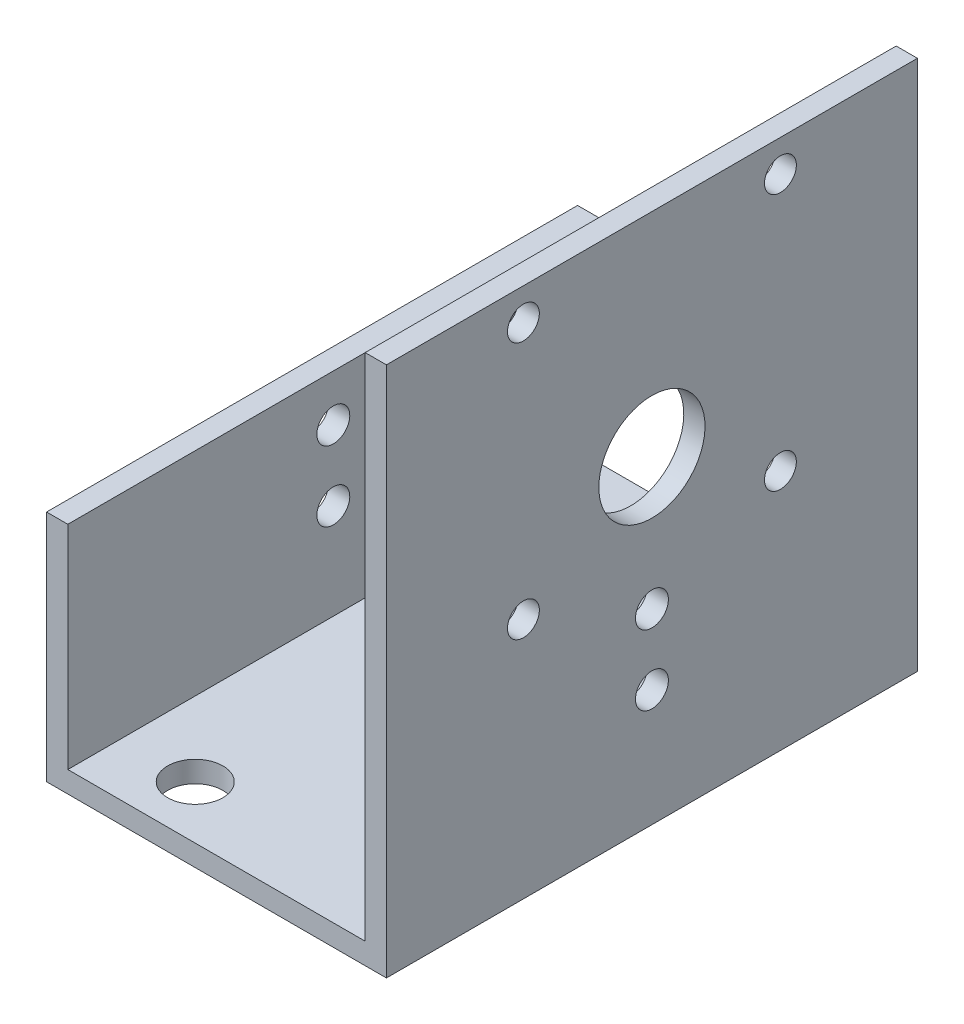
ISO-10303-21;
HEADER;
FILE_DESCRIPTION(('STEP AP214'),'2;1');
FILE_NAME('part.step','',(''),(''),'','','');
FILE_SCHEMA(('AUTOMOTIVE_DESIGN { 1 0 10303 214 1 1 1 1 }'));
ENDSEC;
DATA;
#1=APPLICATION_CONTEXT('core data for automotive mechanical design processes');
#2=APPLICATION_PROTOCOL_DEFINITION('international standard','automotive_design',2000,#1);
#3=PRODUCT_CONTEXT('',#1,'mechanical');
#4=PRODUCT('Part','Part','',(#3));
#5=PRODUCT_RELATED_PRODUCT_CATEGORY('part','',(#4));
#6=PRODUCT_DEFINITION_FORMATION('','',#4);
#7=PRODUCT_DEFINITION_CONTEXT('part definition',#1,'design');
#8=PRODUCT_DEFINITION('design','',#6,#7);
#9=PRODUCT_DEFINITION_SHAPE('','',#8);
#10=(LENGTH_UNIT() NAMED_UNIT(*) SI_UNIT(.MILLI.,.METRE.));
#11=(NAMED_UNIT(*) PLANE_ANGLE_UNIT() SI_UNIT($,.RADIAN.));
#12=(NAMED_UNIT(*) SI_UNIT($,.STERADIAN.) SOLID_ANGLE_UNIT());
#13=UNCERTAINTY_MEASURE_WITH_UNIT(LENGTH_MEASURE(1.E-05),#10,'distance_accuracy_value','');
#14=(GEOMETRIC_REPRESENTATION_CONTEXT(3) GLOBAL_UNCERTAINTY_ASSIGNED_CONTEXT((#13)) GLOBAL_UNIT_ASSIGNED_CONTEXT((#10,
#11,#12)) REPRESENTATION_CONTEXT('',''));
#15=CARTESIAN_POINT('',(0.,0.,0.));
#16=DIRECTION('',(0.,0.,1.));
#17=DIRECTION('',(1.,0.,0.));
#18=AXIS2_PLACEMENT_3D('',#15,#16,#17);
#19=CARTESIAN_POINT('',(0.,0.,25.));
#20=DIRECTION('',(1.,0.,0.));
#21=DIRECTION('',(0.,1.,0.));
#22=AXIS2_PLACEMENT_3D('',#19,#20,#21);
#23=PLANE('',#22);
#24=CARTESIAN_POINT('',(0.,-39.,0.));
#25=DIRECTION('',(1.,0.,0.));
#26=DIRECTION('',(0.,1.,0.));
#27=AXIS2_PLACEMENT_3D('',#24,#25,#26);
#28=CIRCLE('',#27,1.55);
#29=CARTESIAN_POINT('',(0.,-37.45,0.));
#30=VERTEX_POINT('',#29);
#31=EDGE_CURVE('E202',#30,#30,#28,.T.);
#32=ORIENTED_EDGE('',*,*,#31,.T.);
#33=EDGE_LOOP('',(#32));
#34=FACE_BOUND('',#33,.T.);
#35=CARTESIAN_POINT('',(0.,-32.4,0.));
#36=DIRECTION('',(1.,0.,0.));
#37=DIRECTION('',(0.,1.,0.));
#38=AXIS2_PLACEMENT_3D('',#35,#36,#37);
#39=CIRCLE('',#38,1.55);
#40=CARTESIAN_POINT('',(0.,-30.85,0.));
#41=VERTEX_POINT('',#40);
#42=EDGE_CURVE('E206',#41,#41,#39,.T.);
#43=ORIENTED_EDGE('',*,*,#42,.T.);
#44=EDGE_LOOP('',(#43));
#45=FACE_BOUND('',#44,.T.);
#46=CARTESIAN_POINT('',(0.,-20.,0.));
#47=DIRECTION('',(1.,0.,0.));
#48=DIRECTION('',(0.,1.,0.));
#49=AXIS2_PLACEMENT_3D('',#46,#47,#48);
#50=CIRCLE('',#49,5.);
#51=CARTESIAN_POINT('',(0.,-15.,0.));
#52=VERTEX_POINT('',#51);
#53=EDGE_CURVE('E210',#52,#52,#50,.T.);
#54=ORIENTED_EDGE('',*,*,#53,.T.);
#55=EDGE_LOOP('',(#54));
#56=FACE_BOUND('',#55,.T.);
#57=CARTESIAN_POINT('',(0.,-3.,-12.1));
#58=DIRECTION('',(1.,0.,0.));
#59=DIRECTION('',(0.,1.,0.));
#60=AXIS2_PLACEMENT_3D('',#57,#58,#59);
#61=CIRCLE('',#60,1.5);
#62=CARTESIAN_POINT('',(0.,-1.5,-12.1));
#63=VERTEX_POINT('',#62);
#64=EDGE_CURVE('E214',#63,#63,#61,.T.);
#65=ORIENTED_EDGE('',*,*,#64,.T.);
#66=EDGE_LOOP('',(#65));
#67=FACE_BOUND('',#66,.T.);
#68=CARTESIAN_POINT('',(0.,-27.2,-12.1));
#69=DIRECTION('',(1.,0.,0.));
#70=DIRECTION('',(0.,1.,0.));
#71=AXIS2_PLACEMENT_3D('',#68,#69,#70);
#72=CIRCLE('',#71,1.5);
#73=CARTESIAN_POINT('',(0.,-25.7,-12.1));
#74=VERTEX_POINT('',#73);
#75=EDGE_CURVE('E218',#74,#74,#72,.T.);
#76=ORIENTED_EDGE('',*,*,#75,.T.);
#77=EDGE_LOOP('',(#76));
#78=FACE_BOUND('',#77,.T.);
#79=CARTESIAN_POINT('',(0.,-27.2,12.1));
#80=DIRECTION('',(1.,0.,0.));
#81=DIRECTION('',(0.,1.,0.));
#82=AXIS2_PLACEMENT_3D('',#79,#80,#81);
#83=CIRCLE('',#82,1.5);
#84=CARTESIAN_POINT('',(0.,-25.7,12.1));
#85=VERTEX_POINT('',#84);
#86=EDGE_CURVE('E222',#85,#85,#83,.T.);
#87=ORIENTED_EDGE('',*,*,#86,.T.);
#88=EDGE_LOOP('',(#87));
#89=FACE_BOUND('',#88,.T.);
#90=CARTESIAN_POINT('',(0.,-3.,12.1));
#91=DIRECTION('',(1.,0.,0.));
#92=DIRECTION('',(0.,1.,0.));
#93=AXIS2_PLACEMENT_3D('',#90,#91,#92);
#94=CIRCLE('',#93,1.5);
#95=CARTESIAN_POINT('',(0.,-1.5,12.1));
#96=VERTEX_POINT('',#95);
#97=EDGE_CURVE('E114',#96,#96,#94,.T.);
#98=ORIENTED_EDGE('',*,*,#97,.T.);
#99=EDGE_LOOP('',(#98));
#100=FACE_BOUND('',#99,.T.);
#101=DIRECTION('',(0.,-1.,0.));
#102=VECTOR('',#101,1.);
#103=CARTESIAN_POINT('',(0.,0.,-25.));
#104=LINE('',#103,#102);
#105=CARTESIAN_POINT('',(0.,0.,-25.));
#106=VERTEX_POINT('',#105);
#107=CARTESIAN_POINT('',(0.,-48.,-25.));
#108=VERTEX_POINT('',#107);
#109=EDGE_CURVE('E100',#106,#108,#104,.T.);
#110=ORIENTED_EDGE('',*,*,#109,.T.);
#111=DIRECTION('',(0.,0.,-1.));
#112=VECTOR('',#111,1.);
#113=CARTESIAN_POINT('',(0.,-48.,25.));
#114=LINE('',#113,#112);
#115=CARTESIAN_POINT('',(0.,-48.,25.));
#116=VERTEX_POINT('',#115);
#117=EDGE_CURVE('E11',#116,#108,#114,.T.);
#118=ORIENTED_EDGE('',*,*,#117,.F.);
#119=DIRECTION('',(0.,-1.,0.));
#120=VECTOR('',#119,1.);
#121=CARTESIAN_POINT('',(0.,0.,25.));
#122=LINE('',#121,#120);
#123=CARTESIAN_POINT('',(0.,0.,25.));
#124=VERTEX_POINT('',#123);
#125=EDGE_CURVE('E133',#124,#116,#122,.T.);
#126=ORIENTED_EDGE('',*,*,#125,.F.);
#127=DIRECTION('',(0.,0.,-1.));
#128=VECTOR('',#127,1.);
#129=CARTESIAN_POINT('',(0.,0.,25.));
#130=LINE('',#129,#128);
#131=EDGE_CURVE('E113',#124,#106,#130,.T.);
#132=ORIENTED_EDGE('',*,*,#131,.T.);
#133=EDGE_LOOP('',(#110,#118,#126,#132));
#134=FACE_BOUND('',#133,.T.);
#135=ADVANCED_FACE('F32',(#34,#45,#56,#67,#78,#89,#100,#134),#23,.F.);
#136=CARTESIAN_POINT('',(0.,-48.,25.));
#137=DIRECTION('',(0.,-1.,0.));
#138=DIRECTION('',(1.,0.,0.));
#139=AXIS2_PLACEMENT_3D('',#136,#137,#138);
#140=PLANE('',#139);
#141=CARTESIAN_POINT('',(-21.,-48.,-20.));
#142=DIRECTION('',(0.,-1.,0.));
#143=DIRECTION('',(1.,0.,0.));
#144=AXIS2_PLACEMENT_3D('',#141,#142,#143);
#145=CIRCLE('',#144,2.6);
#146=CARTESIAN_POINT('',(-18.4,-48.,-20.));
#147=VERTEX_POINT('',#146);
#148=EDGE_CURVE('E276',#147,#147,#145,.T.);
#149=ORIENTED_EDGE('',*,*,#148,.T.);
#150=EDGE_LOOP('',(#149));
#151=FACE_BOUND('',#150,.T.);
#152=CARTESIAN_POINT('',(-21.,-48.,20.));
#153=DIRECTION('',(0.,-1.,0.));
#154=DIRECTION('',(1.,0.,0.));
#155=AXIS2_PLACEMENT_3D('',#152,#153,#154);
#156=CIRCLE('',#155,2.6);
#157=CARTESIAN_POINT('',(-18.4,-48.,20.));
#158=VERTEX_POINT('',#157);
#159=EDGE_CURVE('E280',#158,#158,#156,.T.);
#160=ORIENTED_EDGE('',*,*,#159,.T.);
#161=EDGE_LOOP('',(#160));
#162=FACE_BOUND('',#161,.T.);
#163=DIRECTION('',(-1.,0.,0.));
#164=VECTOR('',#163,1.);
#165=CARTESIAN_POINT('',(0.,-48.,-25.));
#166=LINE('',#165,#164);
#167=CARTESIAN_POINT('',(-28.,-48.,-25.));
#168=VERTEX_POINT('',#167);
#169=EDGE_CURVE('E96',#108,#168,#166,.T.);
#170=ORIENTED_EDGE('',*,*,#169,.T.);
#171=DIRECTION('',(0.,0.,-1.));
#172=VECTOR('',#171,1.);
#173=CARTESIAN_POINT('',(-28.,-48.,25.));
#174=LINE('',#173,#172);
#175=CARTESIAN_POINT('',(-28.,-48.,25.));
#176=VERTEX_POINT('',#175);
#177=EDGE_CURVE('E39',#176,#168,#174,.T.);
#178=ORIENTED_EDGE('',*,*,#177,.F.);
#179=DIRECTION('',(-1.,0.,0.));
#180=VECTOR('',#179,1.);
#181=CARTESIAN_POINT('',(0.,-48.,25.));
#182=LINE('',#181,#180);
#183=EDGE_CURVE('E109',#116,#176,#182,.T.);
#184=ORIENTED_EDGE('',*,*,#183,.F.);
#185=ORIENTED_EDGE('',*,*,#117,.T.);
#186=EDGE_LOOP('',(#170,#178,#184,#185));
#187=FACE_BOUND('',#186,.T.);
#188=ADVANCED_FACE('F108',(#151,#162,#187),#140,.F.);
#189=CARTESIAN_POINT('',(-28.,-48.,25.));
#190=DIRECTION('',(-1.,0.,0.));
#191=DIRECTION('',(0.,0.,1.));
#192=AXIS2_PLACEMENT_3D('',#189,#190,#191);
#193=PLANE('',#192);
#194=CARTESIAN_POINT('',(-28.,-39.,0.));
#195=DIRECTION('',(-1.,0.,0.));
#196=DIRECTION('',(0.,0.,1.));
#197=AXIS2_PLACEMENT_3D('',#194,#195,#196);
#198=CIRCLE('',#197,1.55);
#199=CARTESIAN_POINT('',(-28.,-39.,1.55));
#200=VERTEX_POINT('',#199);
#201=EDGE_CURVE('E292',#200,#200,#198,.T.);
#202=ORIENTED_EDGE('',*,*,#201,.T.);
#203=EDGE_LOOP('',(#202));
#204=FACE_BOUND('',#203,.T.);
#205=CARTESIAN_POINT('',(-28.,-32.4,0.));
#206=DIRECTION('',(-1.,0.,0.));
#207=DIRECTION('',(0.,0.,1.));
#208=AXIS2_PLACEMENT_3D('',#205,#206,#207);
#209=CIRCLE('',#208,1.55);
#210=CARTESIAN_POINT('',(-28.,-32.4,1.55));
#211=VERTEX_POINT('',#210);
#212=EDGE_CURVE('E302',#211,#211,#209,.T.);
#213=ORIENTED_EDGE('',*,*,#212,.T.);
#214=EDGE_LOOP('',(#213));
#215=FACE_BOUND('',#214,.T.);
#216=DIRECTION('',(0.,1.,0.));
#217=VECTOR('',#216,1.);
#218=CARTESIAN_POINT('',(-28.,-48.,-25.));
#219=LINE('',#218,#217);
#220=CARTESIAN_POINT('',(-28.,-28.,-25.));
#221=VERTEX_POINT('',#220);
#222=EDGE_CURVE('E102',#168,#221,#219,.T.);
#223=ORIENTED_EDGE('',*,*,#222,.T.);
#224=DIRECTION('',(0.,0.,-1.));
#225=VECTOR('',#224,1.);
#226=CARTESIAN_POINT('',(-28.,-28.,25.));
#227=LINE('',#226,#225);
#228=CARTESIAN_POINT('',(-28.,-28.,25.));
#229=VERTEX_POINT('',#228);
#230=EDGE_CURVE('E159',#229,#221,#227,.T.);
#231=ORIENTED_EDGE('',*,*,#230,.F.);
#232=DIRECTION('',(0.,1.,0.));
#233=VECTOR('',#232,1.);
#234=CARTESIAN_POINT('',(-28.,-48.,25.));
#235=LINE('',#234,#233);
#236=EDGE_CURVE('E136',#176,#229,#235,.T.);
#237=ORIENTED_EDGE('',*,*,#236,.F.);
#238=ORIENTED_EDGE('',*,*,#177,.T.);
#239=EDGE_LOOP('',(#223,#231,#237,#238));
#240=FACE_BOUND('',#239,.T.);
#241=ADVANCED_FACE('F163',(#204,#215,#240),#193,.F.);
#242=CARTESIAN_POINT('',(-28.,-28.,25.));
#243=DIRECTION('',(0.,-1.,0.));
#244=DIRECTION('',(0.,0.,-1.));
#245=AXIS2_PLACEMENT_3D('',#242,#243,#244);
#246=PLANE('',#245);
#247=DIRECTION('',(-1.,0.,0.));
#248=VECTOR('',#247,1.);
#249=CARTESIAN_POINT('',(-28.,-28.,-25.));
#250=LINE('',#249,#248);
#251=CARTESIAN_POINT('',(-30.,-28.,-25.));
#252=VERTEX_POINT('',#251);
#253=EDGE_CURVE('E122',#221,#252,#250,.T.);
#254=ORIENTED_EDGE('',*,*,#253,.T.);
#255=DIRECTION('',(0.,0.,-1.));
#256=VECTOR('',#255,1.);
#257=CARTESIAN_POINT('',(-30.,-28.,25.));
#258=LINE('',#257,#256);
#259=CARTESIAN_POINT('',(-30.,-28.,25.));
#260=VERTEX_POINT('',#259);
#261=EDGE_CURVE('E156',#260,#252,#258,.T.);
#262=ORIENTED_EDGE('',*,*,#261,.F.);
#263=DIRECTION('',(-1.,0.,0.));
#264=VECTOR('',#263,1.);
#265=CARTESIAN_POINT('',(-28.,-28.,25.));
#266=LINE('',#265,#264);
#267=EDGE_CURVE('E138',#229,#260,#266,.T.);
#268=ORIENTED_EDGE('',*,*,#267,.F.);
#269=ORIENTED_EDGE('',*,*,#230,.T.);
#270=EDGE_LOOP('',(#254,#262,#268,#269));
#271=FACE_BOUND('',#270,.T.);
#272=ADVANCED_FACE('F171',(#271),#246,.F.);
#273=CARTESIAN_POINT('',(-30.,-50.,25.));
#274=DIRECTION('',(1.,0.,0.));
#275=DIRECTION('',(0.,0.,-1.));
#276=AXIS2_PLACEMENT_3D('',#273,#274,#275);
#277=PLANE('',#276);
#278=CARTESIAN_POINT('',(-30.,-39.,0.));
#279=DIRECTION('',(1.,0.,0.));
#280=DIRECTION('',(0.,1.,0.));
#281=AXIS2_PLACEMENT_3D('',#278,#279,#280);
#282=CIRCLE('',#281,1.55);
#283=CARTESIAN_POINT('',(-30.,-37.45,0.));
#284=VERTEX_POINT('',#283);
#285=EDGE_CURVE('E289',#284,#284,#282,.T.);
#286=ORIENTED_EDGE('',*,*,#285,.T.);
#287=EDGE_LOOP('',(#286));
#288=FACE_BOUND('',#287,.T.);
#289=CARTESIAN_POINT('',(-30.,-32.4,0.));
#290=DIRECTION('',(1.,0.,0.));
#291=DIRECTION('',(0.,1.,0.));
#292=AXIS2_PLACEMENT_3D('',#289,#290,#291);
#293=CIRCLE('',#292,1.55);
#294=CARTESIAN_POINT('',(-30.,-30.85,0.));
#295=VERTEX_POINT('',#294);
#296=EDGE_CURVE('E299',#295,#295,#293,.T.);
#297=ORIENTED_EDGE('',*,*,#296,.T.);
#298=EDGE_LOOP('',(#297));
#299=FACE_BOUND('',#298,.T.);
#300=DIRECTION('',(0.,-1.,0.));
#301=VECTOR('',#300,1.);
#302=CARTESIAN_POINT('',(-30.,-50.,-25.));
#303=LINE('',#302,#301);
#304=CARTESIAN_POINT('',(-30.,-50.,-25.));
#305=VERTEX_POINT('',#304);
#306=EDGE_CURVE('E124',#252,#305,#303,.T.);
#307=ORIENTED_EDGE('',*,*,#306,.T.);
#308=DIRECTION('',(0.,0.,-1.));
#309=VECTOR('',#308,1.);
#310=CARTESIAN_POINT('',(-30.,-50.,25.));
#311=LINE('',#310,#309);
#312=CARTESIAN_POINT('',(-30.,-50.,25.));
#313=VERTEX_POINT('',#312);
#314=EDGE_CURVE('E153',#313,#305,#311,.T.);
#315=ORIENTED_EDGE('',*,*,#314,.F.);
#316=DIRECTION('',(0.,-1.,0.));
#317=VECTOR('',#316,1.);
#318=CARTESIAN_POINT('',(-30.,-50.,25.));
#319=LINE('',#318,#317);
#320=EDGE_CURVE('E140',#260,#313,#319,.T.);
#321=ORIENTED_EDGE('',*,*,#320,.F.);
#322=ORIENTED_EDGE('',*,*,#261,.T.);
#323=EDGE_LOOP('',(#307,#315,#321,#322));
#324=FACE_BOUND('',#323,.T.);
#325=ADVANCED_FACE('F174',(#288,#299,#324),#277,.F.);
#326=CARTESIAN_POINT('',(2.00000000000001,-50.,25.));
#327=DIRECTION('',(0.,1.,0.));
#328=DIRECTION('',(0.,0.,1.));
#329=AXIS2_PLACEMENT_3D('',#326,#327,#328);
#330=PLANE('',#329);
#331=CARTESIAN_POINT('',(-21.,-50.,-20.));
#332=DIRECTION('',(0.,-1.,0.));
#333=DIRECTION('',(0.,0.,-1.));
#334=AXIS2_PLACEMENT_3D('',#331,#332,#333);
#335=CIRCLE('',#334,2.6);
#336=CARTESIAN_POINT('',(-21.,-50.,-22.6));
#337=VERTEX_POINT('',#336);
#338=EDGE_CURVE('E273',#337,#337,#335,.T.);
#339=ORIENTED_EDGE('',*,*,#338,.F.);
#340=EDGE_LOOP('',(#339));
#341=FACE_BOUND('',#340,.T.);
#342=CARTESIAN_POINT('',(-21.,-50.,20.));
#343=DIRECTION('',(0.,-1.,0.));
#344=DIRECTION('',(0.,0.,-1.));
#345=AXIS2_PLACEMENT_3D('',#342,#343,#344);
#346=CIRCLE('',#345,2.6);
#347=CARTESIAN_POINT('',(-21.,-50.,17.4));
#348=VERTEX_POINT('',#347);
#349=EDGE_CURVE('E277',#348,#348,#346,.T.);
#350=ORIENTED_EDGE('',*,*,#349,.F.);
#351=EDGE_LOOP('',(#350));
#352=FACE_BOUND('',#351,.T.);
#353=DIRECTION('',(1.,0.,0.));
#354=VECTOR('',#353,1.);
#355=CARTESIAN_POINT('',(2.00000000000001,-50.,-25.));
#356=LINE('',#355,#354);
#357=CARTESIAN_POINT('',(2.00000000000001,-50.,-25.));
#358=VERTEX_POINT('',#357);
#359=EDGE_CURVE('E127',#305,#358,#356,.T.);
#360=ORIENTED_EDGE('',*,*,#359,.T.);
#361=DIRECTION('',(0.,0.,-1.));
#362=VECTOR('',#361,1.);
#363=CARTESIAN_POINT('',(2.00000000000001,-50.,25.));
#364=LINE('',#363,#362);
#365=CARTESIAN_POINT('',(2.00000000000001,-50.,25.));
#366=VERTEX_POINT('',#365);
#367=EDGE_CURVE('E150',#366,#358,#364,.T.);
#368=ORIENTED_EDGE('',*,*,#367,.F.);
#369=DIRECTION('',(1.,0.,0.));
#370=VECTOR('',#369,1.);
#371=CARTESIAN_POINT('',(-28.,-50.,25.));
#372=LINE('',#371,#370);
#373=EDGE_CURVE('E142',#313,#366,#372,.T.);
#374=ORIENTED_EDGE('',*,*,#373,.F.);
#375=ORIENTED_EDGE('',*,*,#314,.T.);
#376=EDGE_LOOP('',(#360,#368,#374,#375));
#377=FACE_BOUND('',#376,.T.);
#378=ADVANCED_FACE('F178',(#341,#352,#377),#330,.F.);
#379=CARTESIAN_POINT('',(2.,0.,25.));
#380=DIRECTION('',(-1.,0.,0.));
#381=DIRECTION('',(0.,-1.,0.));
#382=AXIS2_PLACEMENT_3D('',#379,#380,#381);
#383=PLANE('',#382);
#384=CARTESIAN_POINT('',(2.,-39.,0.));
#385=DIRECTION('',(1.,0.,0.));
#386=DIRECTION('',(0.,1.,0.));
#387=AXIS2_PLACEMENT_3D('',#384,#385,#386);
#388=CIRCLE('',#387,1.55);
#389=CARTESIAN_POINT('',(2.,-37.45,0.));
#390=VERTEX_POINT('',#389);
#391=EDGE_CURVE('E286',#390,#390,#388,.T.);
#392=ORIENTED_EDGE('',*,*,#391,.F.);
#393=EDGE_LOOP('',(#392));
#394=FACE_BOUND('',#393,.T.);
#395=CARTESIAN_POINT('',(2.,-32.4,0.));
#396=DIRECTION('',(1.,0.,0.));
#397=DIRECTION('',(0.,1.,0.));
#398=AXIS2_PLACEMENT_3D('',#395,#396,#397);
#399=CIRCLE('',#398,1.55);
#400=CARTESIAN_POINT('',(2.,-30.85,0.));
#401=VERTEX_POINT('',#400);
#402=EDGE_CURVE('E296',#401,#401,#399,.T.);
#403=ORIENTED_EDGE('',*,*,#402,.F.);
#404=EDGE_LOOP('',(#403));
#405=FACE_BOUND('',#404,.T.);
#406=CARTESIAN_POINT('',(2.,-20.,0.));
#407=DIRECTION('',(1.,0.,0.));
#408=DIRECTION('',(0.,1.,0.));
#409=AXIS2_PLACEMENT_3D('',#406,#407,#408);
#410=CIRCLE('',#409,5.);
#411=CARTESIAN_POINT('',(2.,-15.,0.));
#412=VERTEX_POINT('',#411);
#413=EDGE_CURVE('E306',#412,#412,#410,.T.);
#414=ORIENTED_EDGE('',*,*,#413,.F.);
#415=EDGE_LOOP('',(#414));
#416=FACE_BOUND('',#415,.T.);
#417=CARTESIAN_POINT('',(2.,-3.,-12.1));
#418=DIRECTION('',(1.,0.,0.));
#419=DIRECTION('',(0.,1.,0.));
#420=AXIS2_PLACEMENT_3D('',#417,#418,#419);
#421=CIRCLE('',#420,1.5);
#422=CARTESIAN_POINT('',(2.,-1.5,-12.1));
#423=VERTEX_POINT('',#422);
#424=EDGE_CURVE('E310',#423,#423,#421,.T.);
#425=ORIENTED_EDGE('',*,*,#424,.F.);
#426=EDGE_LOOP('',(#425));
#427=FACE_BOUND('',#426,.T.);
#428=CARTESIAN_POINT('',(2.,-27.2,-12.1));
#429=DIRECTION('',(1.,0.,0.));
#430=DIRECTION('',(0.,1.,0.));
#431=AXIS2_PLACEMENT_3D('',#428,#429,#430);
#432=CIRCLE('',#431,1.5);
#433=CARTESIAN_POINT('',(2.,-25.7,-12.1));
#434=VERTEX_POINT('',#433);
#435=EDGE_CURVE('E314',#434,#434,#432,.T.);
#436=ORIENTED_EDGE('',*,*,#435,.F.);
#437=EDGE_LOOP('',(#436));
#438=FACE_BOUND('',#437,.T.);
#439=CARTESIAN_POINT('',(2.,-27.2,12.1));
#440=DIRECTION('',(1.,0.,0.));
#441=DIRECTION('',(0.,1.,0.));
#442=AXIS2_PLACEMENT_3D('',#439,#440,#441);
#443=CIRCLE('',#442,1.5);
#444=CARTESIAN_POINT('',(2.,-25.7,12.1));
#445=VERTEX_POINT('',#444);
#446=EDGE_CURVE('E318',#445,#445,#443,.T.);
#447=ORIENTED_EDGE('',*,*,#446,.F.);
#448=EDGE_LOOP('',(#447));
#449=FACE_BOUND('',#448,.T.);
#450=CARTESIAN_POINT('',(2.,-3.,12.1));
#451=DIRECTION('',(1.,0.,0.));
#452=DIRECTION('',(0.,1.,0.));
#453=AXIS2_PLACEMENT_3D('',#450,#451,#452);
#454=CIRCLE('',#453,1.5);
#455=CARTESIAN_POINT('',(2.,-1.5,12.1));
#456=VERTEX_POINT('',#455);
#457=EDGE_CURVE('E117',#456,#456,#454,.T.);
#458=ORIENTED_EDGE('',*,*,#457,.F.);
#459=EDGE_LOOP('',(#458));
#460=FACE_BOUND('',#459,.T.);
#461=DIRECTION('',(0.,1.,0.));
#462=VECTOR('',#461,1.);
#463=CARTESIAN_POINT('',(2.,0.,-25.));
#464=LINE('',#463,#462);
#465=CARTESIAN_POINT('',(2.,0.,-25.));
#466=VERTEX_POINT('',#465);
#467=EDGE_CURVE('E129',#358,#466,#464,.T.);
#468=ORIENTED_EDGE('',*,*,#467,.T.);
#469=DIRECTION('',(0.,0.,-1.));
#470=VECTOR('',#469,1.);
#471=CARTESIAN_POINT('',(2.,0.,25.));
#472=LINE('',#471,#470);
#473=CARTESIAN_POINT('',(2.,0.,25.));
#474=VERTEX_POINT('',#473);
#475=EDGE_CURVE('E147',#474,#466,#472,.T.);
#476=ORIENTED_EDGE('',*,*,#475,.F.);
#477=DIRECTION('',(0.,1.,0.));
#478=VECTOR('',#477,1.);
#479=CARTESIAN_POINT('',(2.,0.,25.));
#480=LINE('',#479,#478);
#481=EDGE_CURVE('E51',#366,#474,#480,.T.);
#482=ORIENTED_EDGE('',*,*,#481,.F.);
#483=ORIENTED_EDGE('',*,*,#367,.T.);
#484=EDGE_LOOP('',(#468,#476,#482,#483));
#485=FACE_BOUND('',#484,.T.);
#486=ADVANCED_FACE('F181',(#394,#405,#416,#427,#438,#449,#460,#485),#383,.F.);
#487=CARTESIAN_POINT('',(0.,0.,25.));
#488=DIRECTION('',(0.,-1.,0.));
#489=DIRECTION('',(0.,0.,-1.));
#490=AXIS2_PLACEMENT_3D('',#487,#488,#489);
#491=PLANE('',#490);
#492=DIRECTION('',(-1.,0.,0.));
#493=VECTOR('',#492,1.);
#494=CARTESIAN_POINT('',(0.,0.,-25.));
#495=LINE('',#494,#493);
#496=EDGE_CURVE('E131',#466,#106,#495,.T.);
#497=ORIENTED_EDGE('',*,*,#496,.T.);
#498=ORIENTED_EDGE('',*,*,#131,.F.);
#499=DIRECTION('',(-1.,0.,0.));
#500=VECTOR('',#499,1.);
#501=CARTESIAN_POINT('',(0.,0.,25.));
#502=LINE('',#501,#500);
#503=EDGE_CURVE('E46',#474,#124,#502,.T.);
#504=ORIENTED_EDGE('',*,*,#503,.F.);
#505=ORIENTED_EDGE('',*,*,#475,.T.);
#506=EDGE_LOOP('',(#497,#498,#504,#505));
#507=FACE_BOUND('',#506,.T.);
#508=ADVANCED_FACE('F183',(#507),#491,.F.);
#509=CARTESIAN_POINT('',(0.,-28.,25.));
#510=DIRECTION('',(0.,0.,-1.));
#511=DIRECTION('',(-1.,0.,0.));
#512=AXIS2_PLACEMENT_3D('',#509,#510,#511);
#513=PLANE('',#512);
#514=ORIENTED_EDGE('',*,*,#125,.T.);
#515=ORIENTED_EDGE('',*,*,#183,.T.);
#516=ORIENTED_EDGE('',*,*,#236,.T.);
#517=ORIENTED_EDGE('',*,*,#267,.T.);
#518=ORIENTED_EDGE('',*,*,#320,.T.);
#519=ORIENTED_EDGE('',*,*,#373,.T.);
#520=ORIENTED_EDGE('',*,*,#481,.T.);
#521=ORIENTED_EDGE('',*,*,#503,.T.);
#522=EDGE_LOOP('',(#514,#515,#516,#517,#518,#519,#520,#521));
#523=FACE_BOUND('',#522,.T.);
#524=ADVANCED_FACE('F166',(#523),#513,.F.);
#525=CARTESIAN_POINT('',(0.,-28.,-25.));
#526=DIRECTION('',(0.,0.,-1.));
#527=DIRECTION('',(-1.,0.,0.));
#528=AXIS2_PLACEMENT_3D('',#525,#526,#527);
#529=PLANE('',#528);
#530=ORIENTED_EDGE('',*,*,#109,.F.);
#531=ORIENTED_EDGE('',*,*,#496,.F.);
#532=ORIENTED_EDGE('',*,*,#467,.F.);
#533=ORIENTED_EDGE('',*,*,#359,.F.);
#534=ORIENTED_EDGE('',*,*,#306,.F.);
#535=ORIENTED_EDGE('',*,*,#253,.F.);
#536=ORIENTED_EDGE('',*,*,#222,.F.);
#537=ORIENTED_EDGE('',*,*,#169,.F.);
#538=EDGE_LOOP('',(#530,#531,#532,#533,#534,#535,#536,#537));
#539=FACE_BOUND('',#538,.T.);
#540=ADVANCED_FACE('F97',(#539),#529,.T.);
#541=CARTESIAN_POINT('',(-8.,-3.,12.1));
#542=DIRECTION('',(1.,0.,0.));
#543=DIRECTION('',(0.,1.,0.));
#544=AXIS2_PLACEMENT_3D('',#541,#542,#543);
#545=CYLINDRICAL_SURFACE('',#544,1.5);
#546=ORIENTED_EDGE('',*,*,#457,.T.);
#547=EDGE_LOOP('',(#546));
#548=FACE_BOUND('',#547,.T.);
#549=ORIENTED_EDGE('',*,*,#97,.F.);
#550=EDGE_LOOP('',(#549));
#551=FACE_BOUND('',#550,.T.);
#552=ADVANCED_FACE('F225',(#548,#551),#545,.F.);
#553=CARTESIAN_POINT('',(-8.,-27.2,12.1));
#554=DIRECTION('',(1.,0.,0.));
#555=DIRECTION('',(0.,1.,0.));
#556=AXIS2_PLACEMENT_3D('',#553,#554,#555);
#557=CYLINDRICAL_SURFACE('',#556,1.5);
#558=ORIENTED_EDGE('',*,*,#446,.T.);
#559=EDGE_LOOP('',(#558));
#560=FACE_BOUND('',#559,.T.);
#561=ORIENTED_EDGE('',*,*,#86,.F.);
#562=EDGE_LOOP('',(#561));
#563=FACE_BOUND('',#562,.T.);
#564=ADVANCED_FACE('F227',(#560,#563),#557,.F.);
#565=CARTESIAN_POINT('',(-8.,-27.2,-12.1));
#566=DIRECTION('',(1.,0.,0.));
#567=DIRECTION('',(0.,1.,0.));
#568=AXIS2_PLACEMENT_3D('',#565,#566,#567);
#569=CYLINDRICAL_SURFACE('',#568,1.5);
#570=ORIENTED_EDGE('',*,*,#435,.T.);
#571=EDGE_LOOP('',(#570));
#572=FACE_BOUND('',#571,.T.);
#573=ORIENTED_EDGE('',*,*,#75,.F.);
#574=EDGE_LOOP('',(#573));
#575=FACE_BOUND('',#574,.T.);
#576=ADVANCED_FACE('F234',(#572,#575),#569,.F.);
#577=CARTESIAN_POINT('',(-8.,-3.,-12.1));
#578=DIRECTION('',(1.,0.,0.));
#579=DIRECTION('',(0.,1.,0.));
#580=AXIS2_PLACEMENT_3D('',#577,#578,#579);
#581=CYLINDRICAL_SURFACE('',#580,1.5);
#582=ORIENTED_EDGE('',*,*,#424,.T.);
#583=EDGE_LOOP('',(#582));
#584=FACE_BOUND('',#583,.T.);
#585=ORIENTED_EDGE('',*,*,#64,.F.);
#586=EDGE_LOOP('',(#585));
#587=FACE_BOUND('',#586,.T.);
#588=ADVANCED_FACE('F242',(#584,#587),#581,.F.);
#589=CARTESIAN_POINT('',(-8.,-20.,0.));
#590=DIRECTION('',(1.,0.,0.));
#591=DIRECTION('',(0.,1.,0.));
#592=AXIS2_PLACEMENT_3D('',#589,#590,#591);
#593=CYLINDRICAL_SURFACE('',#592,5.);
#594=ORIENTED_EDGE('',*,*,#413,.T.);
#595=EDGE_LOOP('',(#594));
#596=FACE_BOUND('',#595,.T.);
#597=ORIENTED_EDGE('',*,*,#53,.F.);
#598=EDGE_LOOP('',(#597));
#599=FACE_BOUND('',#598,.T.);
#600=ADVANCED_FACE('F246',(#596,#599),#593,.F.);
#601=CARTESIAN_POINT('',(-30.,-32.4,0.));
#602=DIRECTION('',(1.,0.,0.));
#603=DIRECTION('',(0.,1.,0.));
#604=AXIS2_PLACEMENT_3D('',#601,#602,#603);
#605=CYLINDRICAL_SURFACE('',#604,1.55);
#606=ORIENTED_EDGE('',*,*,#402,.T.);
#607=EDGE_LOOP('',(#606));
#608=FACE_BOUND('',#607,.T.);
#609=ORIENTED_EDGE('',*,*,#42,.F.);
#610=EDGE_LOOP('',(#609));
#611=FACE_BOUND('',#610,.T.);
#612=ADVANCED_FACE('F250',(#608,#611),#605,.F.);
#613=ORIENTED_EDGE('',*,*,#296,.F.);
#614=EDGE_LOOP('',(#613));
#615=FACE_BOUND('',#614,.T.);
#616=ORIENTED_EDGE('',*,*,#212,.F.);
#617=EDGE_LOOP('',(#616));
#618=FACE_BOUND('',#617,.T.);
#619=ADVANCED_FACE('F254',(#615,#618),#605,.F.);
#620=CARTESIAN_POINT('',(-30.,-39.,0.));
#621=DIRECTION('',(1.,0.,0.));
#622=DIRECTION('',(0.,1.,0.));
#623=AXIS2_PLACEMENT_3D('',#620,#621,#622);
#624=CYLINDRICAL_SURFACE('',#623,1.55);
#625=ORIENTED_EDGE('',*,*,#391,.T.);
#626=EDGE_LOOP('',(#625));
#627=FACE_BOUND('',#626,.T.);
#628=ORIENTED_EDGE('',*,*,#31,.F.);
#629=EDGE_LOOP('',(#628));
#630=FACE_BOUND('',#629,.T.);
#631=ADVANCED_FACE('F256',(#627,#630),#624,.F.);
#632=ORIENTED_EDGE('',*,*,#285,.F.);
#633=EDGE_LOOP('',(#632));
#634=FACE_BOUND('',#633,.T.);
#635=ORIENTED_EDGE('',*,*,#201,.F.);
#636=EDGE_LOOP('',(#635));
#637=FACE_BOUND('',#636,.T.);
#638=ADVANCED_FACE('F259',(#634,#637),#624,.F.);
#639=CARTESIAN_POINT('',(-21.,-40.,20.));
#640=DIRECTION('',(0.,-1.,0.));
#641=DIRECTION('',(0.,0.,-1.));
#642=AXIS2_PLACEMENT_3D('',#639,#640,#641);
#643=CYLINDRICAL_SURFACE('',#642,2.6);
#644=ORIENTED_EDGE('',*,*,#349,.T.);
#645=EDGE_LOOP('',(#644));
#646=FACE_BOUND('',#645,.T.);
#647=ORIENTED_EDGE('',*,*,#159,.F.);
#648=EDGE_LOOP('',(#647));
#649=FACE_BOUND('',#648,.T.);
#650=ADVANCED_FACE('F261',(#646,#649),#643,.F.);
#651=CARTESIAN_POINT('',(-21.,-40.,-20.));
#652=DIRECTION('',(0.,-1.,0.));
#653=DIRECTION('',(0.,0.,-1.));
#654=AXIS2_PLACEMENT_3D('',#651,#652,#653);
#655=CYLINDRICAL_SURFACE('',#654,2.6);
#656=ORIENTED_EDGE('',*,*,#338,.T.);
#657=EDGE_LOOP('',(#656));
#658=FACE_BOUND('',#657,.T.);
#659=ORIENTED_EDGE('',*,*,#148,.F.);
#660=EDGE_LOOP('',(#659));
#661=FACE_BOUND('',#660,.T.);
#662=ADVANCED_FACE('F264',(#658,#661),#655,.F.);
#663=CLOSED_SHELL('',(#135,#188,#241,#272,#325,#378,#486,#508,#524,#540,#552,#564,#576,#588,
#600,#612,#619,#631,#638,#650,#662));
#664=MANIFOLD_SOLID_BREP('B2',#663);
#665=ADVANCED_BREP_SHAPE_REPRESENTATION('',(#18,#664),#14);
#666=SHAPE_DEFINITION_REPRESENTATION(#9,#665);
ENDSEC;
END-ISO-10303-21;
